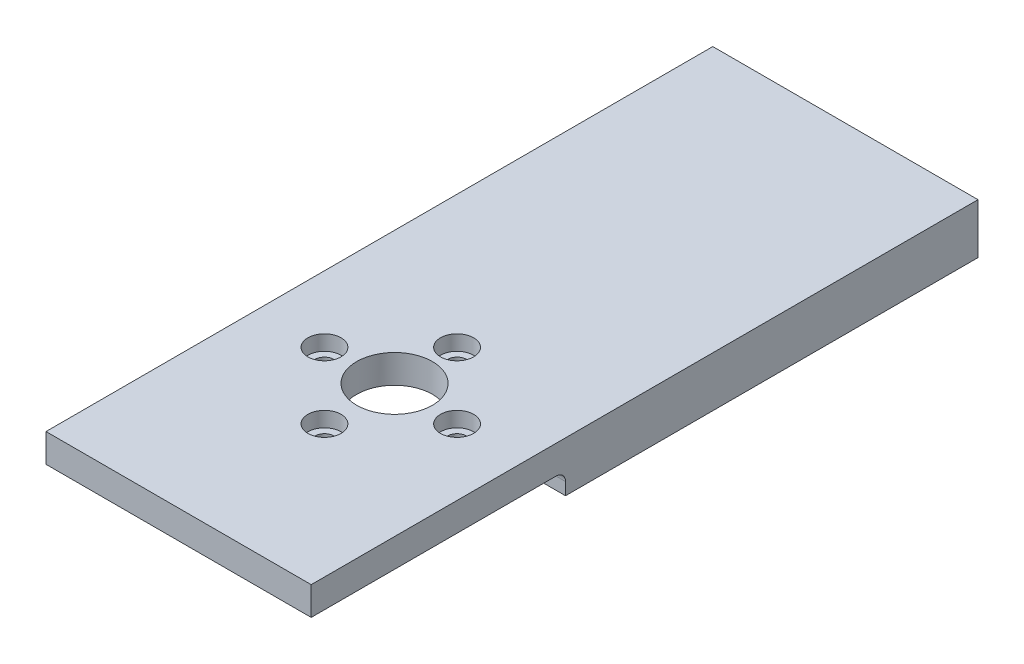
ISO-10303-21;
HEADER;
FILE_DESCRIPTION(('STEP AP214'),'2;1');
FILE_NAME('part.step','',(''),(''),'','','');
FILE_SCHEMA(('AUTOMOTIVE_DESIGN { 1 0 10303 214 1 1 1 1 }'));
ENDSEC;
DATA;
#1=APPLICATION_CONTEXT('core data for automotive mechanical design processes');
#2=APPLICATION_PROTOCOL_DEFINITION('international standard','automotive_design',2000,#1);
#3=PRODUCT_CONTEXT('',#1,'mechanical');
#4=PRODUCT('Part','Part','',(#3));
#5=PRODUCT_RELATED_PRODUCT_CATEGORY('part','',(#4));
#6=PRODUCT_DEFINITION_FORMATION('','',#4);
#7=PRODUCT_DEFINITION_CONTEXT('part definition',#1,'design');
#8=PRODUCT_DEFINITION('design','',#6,#7);
#9=PRODUCT_DEFINITION_SHAPE('','',#8);
#10=(LENGTH_UNIT() NAMED_UNIT(*) SI_UNIT(.MILLI.,.METRE.));
#11=(NAMED_UNIT(*) PLANE_ANGLE_UNIT() SI_UNIT($,.RADIAN.));
#12=(NAMED_UNIT(*) SI_UNIT($,.STERADIAN.) SOLID_ANGLE_UNIT());
#13=UNCERTAINTY_MEASURE_WITH_UNIT(LENGTH_MEASURE(1.E-05),#10,'distance_accuracy_value','');
#14=(GEOMETRIC_REPRESENTATION_CONTEXT(3) GLOBAL_UNCERTAINTY_ASSIGNED_CONTEXT((#13)) GLOBAL_UNIT_ASSIGNED_CONTEXT((#10,
#11,#12)) REPRESENTATION_CONTEXT('',''));
#15=CARTESIAN_POINT('',(0.,0.,0.));
#16=DIRECTION('',(0.,0.,1.));
#17=DIRECTION('',(1.,0.,0.));
#18=AXIS2_PLACEMENT_3D('',#15,#16,#17);
#19=CARTESIAN_POINT('',(7.0000000000001,-7.,12.7999999999978));
#20=DIRECTION('',(0.,1.,0.));
#21=DIRECTION('',(0.,0.,1.));
#22=AXIS2_PLACEMENT_3D('',#19,#20,#21);
#23=CYLINDRICAL_SURFACE('',#22,1.);
#24=CARTESIAN_POINT('',(7.0000000000001,0.,12.7999999999978));
#25=DIRECTION('',(0.,-1.,0.));
#26=DIRECTION('',(0.,0.,-1.));
#27=AXIS2_PLACEMENT_3D('',#24,#25,#26);
#28=CIRCLE('',#27,1.);
#29=CARTESIAN_POINT('',(7.0000000000001,0.,11.7999999999978));
#30=VERTEX_POINT('',#29);
#31=EDGE_CURVE('E224',#30,#30,#28,.T.);
#32=ORIENTED_EDGE('',*,*,#31,.T.);
#33=EDGE_LOOP('',(#32));
#34=FACE_BOUND('',#33,.T.);
#35=CARTESIAN_POINT('',(7.0000000000001,1.4,12.7999999999978));
#36=DIRECTION('',(0.,1.,0.));
#37=DIRECTION('',(0.,0.,1.));
#38=AXIS2_PLACEMENT_3D('',#35,#36,#37);
#39=CIRCLE('',#38,1.);
#40=CARTESIAN_POINT('',(7.0000000000001,1.4,13.7999999999978));
#41=VERTEX_POINT('',#40);
#42=EDGE_CURVE('E173',#41,#41,#39,.F.);
#43=ORIENTED_EDGE('',*,*,#42,.F.);
#44=EDGE_LOOP('',(#43));
#45=FACE_BOUND('',#44,.T.);
#46=ADVANCED_FACE('F39',(#34,#45),#23,.F.);
#47=CARTESIAN_POINT('',(-6.9999999999999,-7.,12.7999999999979));
#48=DIRECTION('',(0.,1.,0.));
#49=DIRECTION('',(0.,0.,1.));
#50=AXIS2_PLACEMENT_3D('',#47,#48,#49);
#51=CYLINDRICAL_SURFACE('',#50,1.);
#52=CARTESIAN_POINT('',(-6.9999999999999,0.,12.7999999999979));
#53=DIRECTION('',(0.,-1.,0.));
#54=DIRECTION('',(0.,0.,-1.));
#55=AXIS2_PLACEMENT_3D('',#52,#53,#54);
#56=CIRCLE('',#55,1.);
#57=CARTESIAN_POINT('',(-6.9999999999999,0.,11.7999999999979));
#58=VERTEX_POINT('',#57);
#59=EDGE_CURVE('E230',#58,#58,#56,.T.);
#60=ORIENTED_EDGE('',*,*,#59,.T.);
#61=EDGE_LOOP('',(#60));
#62=FACE_BOUND('',#61,.T.);
#63=CARTESIAN_POINT('',(-6.9999999999999,1.4,12.7999999999979));
#64=DIRECTION('',(0.,1.,0.));
#65=DIRECTION('',(0.,0.,1.));
#66=AXIS2_PLACEMENT_3D('',#63,#64,#65);
#67=CIRCLE('',#66,1.);
#68=CARTESIAN_POINT('',(-6.9999999999999,1.4,13.7999999999979));
#69=VERTEX_POINT('',#68);
#70=EDGE_CURVE('E179',#69,#69,#67,.F.);
#71=ORIENTED_EDGE('',*,*,#70,.F.);
#72=EDGE_LOOP('',(#71));
#73=FACE_BOUND('',#72,.T.);
#74=ADVANCED_FACE('F269',(#62,#73),#51,.F.);
#75=CARTESIAN_POINT('',(0.,-7.,5.79999999999792));
#76=DIRECTION('',(0.,1.,0.));
#77=DIRECTION('',(0.,0.,1.));
#78=AXIS2_PLACEMENT_3D('',#75,#76,#77);
#79=CYLINDRICAL_SURFACE('',#78,1.);
#80=CARTESIAN_POINT('',(0.,0.,5.79999999999792));
#81=DIRECTION('',(0.,-1.,0.));
#82=DIRECTION('',(0.,0.,-1.));
#83=AXIS2_PLACEMENT_3D('',#80,#81,#82);
#84=CIRCLE('',#83,1.);
#85=CARTESIAN_POINT('',(0.,0.,4.79999999999792));
#86=VERTEX_POINT('',#85);
#87=EDGE_CURVE('E213',#86,#86,#84,.T.);
#88=ORIENTED_EDGE('',*,*,#87,.T.);
#89=EDGE_LOOP('',(#88));
#90=FACE_BOUND('',#89,.T.);
#91=CARTESIAN_POINT('',(0.,1.4,5.79999999999792));
#92=DIRECTION('',(0.,1.,0.));
#93=DIRECTION('',(0.,0.,1.));
#94=AXIS2_PLACEMENT_3D('',#91,#92,#93);
#95=CIRCLE('',#94,1.);
#96=CARTESIAN_POINT('',(0.,1.4,6.79999999999792));
#97=VERTEX_POINT('',#96);
#98=EDGE_CURVE('E186',#97,#97,#95,.F.);
#99=ORIENTED_EDGE('',*,*,#98,.F.);
#100=EDGE_LOOP('',(#99));
#101=FACE_BOUND('',#100,.T.);
#102=ADVANCED_FACE('F275',(#90,#101),#79,.F.);
#103=CARTESIAN_POINT('',(1.45764745514838E-13,-7.,19.7999999999979));
#104=DIRECTION('',(0.,1.,0.));
#105=DIRECTION('',(0.,0.,1.));
#106=AXIS2_PLACEMENT_3D('',#103,#104,#105);
#107=CYLINDRICAL_SURFACE('',#106,1.);
#108=CARTESIAN_POINT('',(1.45764745514838E-13,0.,19.7999999999979));
#109=DIRECTION('',(0.,-1.,0.));
#110=DIRECTION('',(0.,0.,-1.));
#111=AXIS2_PLACEMENT_3D('',#108,#109,#110);
#112=CIRCLE('',#111,1.);
#113=CARTESIAN_POINT('',(1.45764745514838E-13,0.,18.7999999999979));
#114=VERTEX_POINT('',#113);
#115=EDGE_CURVE('E227',#114,#114,#112,.T.);
#116=ORIENTED_EDGE('',*,*,#115,.T.);
#117=EDGE_LOOP('',(#116));
#118=FACE_BOUND('',#117,.T.);
#119=CARTESIAN_POINT('',(1.45764745514838E-13,1.4,19.7999999999979));
#120=DIRECTION('',(0.,1.,0.));
#121=DIRECTION('',(0.,0.,1.));
#122=AXIS2_PLACEMENT_3D('',#119,#120,#121);
#123=CIRCLE('',#122,1.);
#124=CARTESIAN_POINT('',(1.45764745514838E-13,1.4,20.7999999999979));
#125=VERTEX_POINT('',#124);
#126=EDGE_CURVE('E193',#125,#125,#123,.F.);
#127=ORIENTED_EDGE('',*,*,#126,.F.);
#128=EDGE_LOOP('',(#127));
#129=FACE_BOUND('',#128,.T.);
#130=ADVANCED_FACE('F281',(#118,#129),#107,.F.);
#131=CARTESIAN_POINT('',(14.,3.,35.2));
#132=DIRECTION('',(-1.,0.,0.));
#133=DIRECTION('',(0.,0.,1.));
#134=AXIS2_PLACEMENT_3D('',#131,#132,#133);
#135=PLANE('',#134);
#136=DIRECTION('',(0.,0.,-1.));
#137=VECTOR('',#136,1.);
#138=CARTESIAN_POINT('',(14.,0.,35.2));
#139=LINE('',#138,#137);
#140=CARTESIAN_POINT('',(14.,0.,35.2));
#141=VERTEX_POINT('',#140);
#142=CARTESIAN_POINT('',(14.,0.,9.35060235316424));
#143=VERTEX_POINT('',#142);
#144=EDGE_CURVE('E210',#141,#143,#139,.T.);
#145=ORIENTED_EDGE('',*,*,#144,.T.);
#146=CARTESIAN_POINT('',(14.,-1.,9.35060235316424));
#147=DIRECTION('',(-1.,0.,0.));
#148=DIRECTION('',(0.,0.,1.));
#149=AXIS2_PLACEMENT_3D('',#146,#147,#148);
#150=CIRCLE('',#149,1.);
#151=CARTESIAN_POINT('',(14.,-1.,8.35060235316424));
#152=VERTEX_POINT('',#151);
#153=EDGE_CURVE('E53',#143,#152,#150,.T.);
#154=ORIENTED_EDGE('',*,*,#153,.T.);
#155=DIRECTION('',(0.,1.,0.));
#156=VECTOR('',#155,1.);
#157=CARTESIAN_POINT('',(14.,-2.3,8.35060235316424));
#158=LINE('',#157,#156);
#159=CARTESIAN_POINT('',(14.,-2.3,8.35060235316424));
#160=VERTEX_POINT('',#159);
#161=EDGE_CURVE('E143',#160,#152,#158,.T.);
#162=ORIENTED_EDGE('',*,*,#161,.F.);
#163=DIRECTION('',(0.,0.,1.));
#164=VECTOR('',#163,1.);
#165=CARTESIAN_POINT('',(14.,-2.3,-35.2));
#166=LINE('',#165,#164);
#167=CARTESIAN_POINT('',(14.,-2.3,-35.2));
#168=VERTEX_POINT('',#167);
#169=EDGE_CURVE('E139',#168,#160,#166,.T.);
#170=ORIENTED_EDGE('',*,*,#169,.F.);
#171=DIRECTION('',(0.,-1.,0.));
#172=VECTOR('',#171,1.);
#173=CARTESIAN_POINT('',(14.,3.,-35.2));
#174=LINE('',#173,#172);
#175=CARTESIAN_POINT('',(14.,3.,-35.2));
#176=VERTEX_POINT('',#175);
#177=EDGE_CURVE('E125',#176,#168,#174,.T.);
#178=ORIENTED_EDGE('',*,*,#177,.F.);
#179=DIRECTION('',(0.,0.,-1.));
#180=VECTOR('',#179,1.);
#181=CARTESIAN_POINT('',(14.,3.,35.2));
#182=LINE('',#181,#180);
#183=CARTESIAN_POINT('',(14.,3.,35.2));
#184=VERTEX_POINT('',#183);
#185=EDGE_CURVE('E201',#184,#176,#182,.T.);
#186=ORIENTED_EDGE('',*,*,#185,.F.);
#187=DIRECTION('',(0.,-1.,0.));
#188=VECTOR('',#187,1.);
#189=CARTESIAN_POINT('',(14.,3.,35.2));
#190=LINE('',#189,#188);
#191=EDGE_CURVE('E209',#184,#141,#190,.T.);
#192=ORIENTED_EDGE('',*,*,#191,.T.);
#193=EDGE_LOOP('',(#145,#154,#162,#170,#178,#186,#192));
#194=FACE_BOUND('',#193,.T.);
#195=ADVANCED_FACE('F141',(#194),#135,.F.);
#196=CARTESIAN_POINT('',(-14.,3.,-35.2));
#197=DIRECTION('',(0.,0.,1.));
#198=DIRECTION('',(1.,0.,0.));
#199=AXIS2_PLACEMENT_3D('',#196,#197,#198);
#200=PLANE('',#199);
#201=ORIENTED_EDGE('',*,*,#177,.T.);
#202=DIRECTION('',(1.,0.,0.));
#203=VECTOR('',#202,1.);
#204=CARTESIAN_POINT('',(-14.,-2.3,-35.2));
#205=LINE('',#204,#203);
#206=CARTESIAN_POINT('',(-14.,-2.3,-35.2));
#207=VERTEX_POINT('',#206);
#208=EDGE_CURVE('E130',#207,#168,#205,.T.);
#209=ORIENTED_EDGE('',*,*,#208,.F.);
#210=DIRECTION('',(0.,-1.,0.));
#211=VECTOR('',#210,1.);
#212=CARTESIAN_POINT('',(-14.,3.,-35.2));
#213=LINE('',#212,#211);
#214=CARTESIAN_POINT('',(-14.,3.,-35.2));
#215=VERTEX_POINT('',#214);
#216=EDGE_CURVE('E136',#215,#207,#213,.T.);
#217=ORIENTED_EDGE('',*,*,#216,.F.);
#218=DIRECTION('',(-1.,0.,0.));
#219=VECTOR('',#218,1.);
#220=CARTESIAN_POINT('',(-14.,3.,-35.2));
#221=LINE('',#220,#219);
#222=EDGE_CURVE('E131',#176,#215,#221,.T.);
#223=ORIENTED_EDGE('',*,*,#222,.F.);
#224=EDGE_LOOP('',(#201,#209,#217,#223));
#225=FACE_BOUND('',#224,.T.);
#226=ADVANCED_FACE('F127',(#225),#200,.F.);
#227=CARTESIAN_POINT('',(-14.,3.,35.2));
#228=DIRECTION('',(1.,0.,0.));
#229=DIRECTION('',(0.,0.,-1.));
#230=AXIS2_PLACEMENT_3D('',#227,#228,#229);
#231=PLANE('',#230);
#232=ORIENTED_EDGE('',*,*,#216,.T.);
#233=DIRECTION('',(0.,0.,-1.));
#234=VECTOR('',#233,1.);
#235=CARTESIAN_POINT('',(-14.,-2.3,8.35060235316424));
#236=LINE('',#235,#234);
#237=CARTESIAN_POINT('',(-14.,-2.3,8.35060235316424));
#238=VERTEX_POINT('',#237);
#239=EDGE_CURVE('E151',#238,#207,#236,.T.);
#240=ORIENTED_EDGE('',*,*,#239,.F.);
#241=DIRECTION('',(0.,1.,0.));
#242=VECTOR('',#241,1.);
#243=CARTESIAN_POINT('',(-14.,-2.3,8.35060235316424));
#244=LINE('',#243,#242);
#245=CARTESIAN_POINT('',(-14.,-1.,8.35060235316424));
#246=VERTEX_POINT('',#245);
#247=EDGE_CURVE('E162',#238,#246,#244,.T.);
#248=ORIENTED_EDGE('',*,*,#247,.T.);
#249=CARTESIAN_POINT('',(-14.,-1.,9.35060235316424));
#250=DIRECTION('',(1.,0.,0.));
#251=DIRECTION('',(0.,0.,-1.));
#252=AXIS2_PLACEMENT_3D('',#249,#250,#251);
#253=CIRCLE('',#252,1.);
#254=CARTESIAN_POINT('',(-14.,0.,9.35060235316424));
#255=VERTEX_POINT('',#254);
#256=EDGE_CURVE('E11',#246,#255,#253,.T.);
#257=ORIENTED_EDGE('',*,*,#256,.T.);
#258=DIRECTION('',(0.,0.,1.));
#259=VECTOR('',#258,1.);
#260=CARTESIAN_POINT('',(-14.,0.,35.2));
#261=LINE('',#260,#259);
#262=CARTESIAN_POINT('',(-14.,0.,35.2));
#263=VERTEX_POINT('',#262);
#264=EDGE_CURVE('E212',#255,#263,#261,.T.);
#265=ORIENTED_EDGE('',*,*,#264,.T.);
#266=DIRECTION('',(0.,-1.,0.));
#267=VECTOR('',#266,1.);
#268=CARTESIAN_POINT('',(-14.,3.,35.2));
#269=LINE('',#268,#267);
#270=CARTESIAN_POINT('',(-14.,3.,35.2));
#271=VERTEX_POINT('',#270);
#272=EDGE_CURVE('E218',#271,#263,#269,.T.);
#273=ORIENTED_EDGE('',*,*,#272,.F.);
#274=DIRECTION('',(0.,0.,1.));
#275=VECTOR('',#274,1.);
#276=CARTESIAN_POINT('',(-14.,3.,35.2));
#277=LINE('',#276,#275);
#278=EDGE_CURVE('E205',#215,#271,#277,.T.);
#279=ORIENTED_EDGE('',*,*,#278,.F.);
#280=EDGE_LOOP('',(#232,#240,#248,#257,#265,#273,#279));
#281=FACE_BOUND('',#280,.T.);
#282=ADVANCED_FACE('F297',(#281),#231,.F.);
#283=CARTESIAN_POINT('',(-14.,3.,35.2));
#284=DIRECTION('',(0.,0.,-1.));
#285=DIRECTION('',(-1.,0.,0.));
#286=AXIS2_PLACEMENT_3D('',#283,#284,#285);
#287=PLANE('',#286);
#288=DIRECTION('',(1.,0.,0.));
#289=VECTOR('',#288,1.);
#290=CARTESIAN_POINT('',(-14.,0.,35.2));
#291=LINE('',#290,#289);
#292=EDGE_CURVE('E203',#263,#141,#291,.T.);
#293=ORIENTED_EDGE('',*,*,#292,.T.);
#294=ORIENTED_EDGE('',*,*,#191,.F.);
#295=DIRECTION('',(1.,0.,0.));
#296=VECTOR('',#295,1.);
#297=CARTESIAN_POINT('',(-14.,3.,35.2));
#298=LINE('',#297,#296);
#299=EDGE_CURVE('E207',#271,#184,#298,.T.);
#300=ORIENTED_EDGE('',*,*,#299,.F.);
#301=ORIENTED_EDGE('',*,*,#272,.T.);
#302=EDGE_LOOP('',(#293,#294,#300,#301));
#303=FACE_BOUND('',#302,.T.);
#304=ADVANCED_FACE('F289',(#303),#287,.F.);
#305=CARTESIAN_POINT('',(0.,3.,0.));
#306=DIRECTION('',(0.,-1.,0.));
#307=DIRECTION('',(0.,0.,-1.));
#308=AXIS2_PLACEMENT_3D('',#305,#306,#307);
#309=PLANE('',#308);
#310=CARTESIAN_POINT('',(7.0000000000001,3.,12.7999999999978));
#311=DIRECTION('',(0.,1.,0.));
#312=DIRECTION('',(0.,0.,1.));
#313=AXIS2_PLACEMENT_3D('',#310,#311,#312);
#314=CIRCLE('',#313,1.75);
#315=CARTESIAN_POINT('',(7.0000000000001,3.,14.5499999999978));
#316=VERTEX_POINT('',#315);
#317=EDGE_CURVE('E169',#316,#316,#314,.T.);
#318=ORIENTED_EDGE('',*,*,#317,.F.);
#319=EDGE_LOOP('',(#318));
#320=FACE_BOUND('',#319,.T.);
#321=CARTESIAN_POINT('',(-6.9999999999999,3.,12.7999999999979));
#322=DIRECTION('',(0.,1.,0.));
#323=DIRECTION('',(0.,0.,1.));
#324=AXIS2_PLACEMENT_3D('',#321,#322,#323);
#325=CIRCLE('',#324,1.75);
#326=CARTESIAN_POINT('',(-6.9999999999999,3.,14.5499999999979));
#327=VERTEX_POINT('',#326);
#328=EDGE_CURVE('E180',#327,#327,#325,.T.);
#329=ORIENTED_EDGE('',*,*,#328,.F.);
#330=EDGE_LOOP('',(#329));
#331=FACE_BOUND('',#330,.T.);
#332=CARTESIAN_POINT('',(0.,3.,5.79999999999792));
#333=DIRECTION('',(0.,1.,0.));
#334=DIRECTION('',(0.,0.,1.));
#335=AXIS2_PLACEMENT_3D('',#332,#333,#334);
#336=CIRCLE('',#335,1.75);
#337=CARTESIAN_POINT('',(0.,3.,7.54999999999792));
#338=VERTEX_POINT('',#337);
#339=EDGE_CURVE('E187',#338,#338,#336,.T.);
#340=ORIENTED_EDGE('',*,*,#339,.F.);
#341=EDGE_LOOP('',(#340));
#342=FACE_BOUND('',#341,.T.);
#343=CARTESIAN_POINT('',(1.45764745514838E-13,3.,19.7999999999979));
#344=DIRECTION('',(0.,1.,0.));
#345=DIRECTION('',(0.,0.,1.));
#346=AXIS2_PLACEMENT_3D('',#343,#344,#345);
#347=CIRCLE('',#346,1.75);
#348=CARTESIAN_POINT('',(1.45764745514838E-13,3.,21.5499999999979));
#349=VERTEX_POINT('',#348);
#350=EDGE_CURVE('E194',#349,#349,#347,.T.);
#351=ORIENTED_EDGE('',*,*,#350,.F.);
#352=EDGE_LOOP('',(#351));
#353=FACE_BOUND('',#352,.T.);
#354=CARTESIAN_POINT('',(0.,3.,12.3999999999985));
#355=DIRECTION('',(0.,1.,0.));
#356=DIRECTION('',(0.,0.,1.));
#357=AXIS2_PLACEMENT_3D('',#354,#355,#356);
#358=CIRCLE('',#357,4.);
#359=CARTESIAN_POINT('',(0.,3.,16.3999999999985));
#360=VERTEX_POINT('',#359);
#361=EDGE_CURVE('E197',#360,#360,#358,.T.);
#362=ORIENTED_EDGE('',*,*,#361,.F.);
#363=EDGE_LOOP('',(#362));
#364=FACE_BOUND('',#363,.T.);
#365=ORIENTED_EDGE('',*,*,#185,.T.);
#366=ORIENTED_EDGE('',*,*,#222,.T.);
#367=ORIENTED_EDGE('',*,*,#278,.T.);
#368=ORIENTED_EDGE('',*,*,#299,.T.);
#369=EDGE_LOOP('',(#365,#366,#367,#368));
#370=FACE_BOUND('',#369,.T.);
#371=ADVANCED_FACE('F285',(#320,#331,#342,#353,#364,#370),#309,.F.);
#372=CARTESIAN_POINT('',(0.,0.,0.));
#373=DIRECTION('',(0.,-1.,0.));
#374=DIRECTION('',(0.,0.,-1.));
#375=AXIS2_PLACEMENT_3D('',#372,#373,#374);
#376=PLANE('',#375);
#377=CARTESIAN_POINT('',(0.,0.,12.3999999999985));
#378=DIRECTION('',(0.,-1.,0.));
#379=DIRECTION('',(0.,0.,-1.));
#380=AXIS2_PLACEMENT_3D('',#377,#378,#379);
#381=CIRCLE('',#380,9.);
#382=CARTESIAN_POINT('',(-8.46765457440736,0.,9.35060235316428));
#383=VERTEX_POINT('',#382);
#384=CARTESIAN_POINT('',(8.46765457440736,0.,9.35060235316428));
#385=VERTEX_POINT('',#384);
#386=EDGE_CURVE('E245',#383,#385,#381,.T.);
#387=ORIENTED_EDGE('',*,*,#386,.T.);
#388=DIRECTION('',(-1.,0.,0.));
#389=VECTOR('',#388,1.);
#390=CARTESIAN_POINT('',(0.,0.,9.35060235316423));
#391=LINE('',#390,#389);
#392=EDGE_CURVE('E249',#385,#143,#391,.F.);
#393=ORIENTED_EDGE('',*,*,#392,.T.);
#394=ORIENTED_EDGE('',*,*,#144,.F.);
#395=ORIENTED_EDGE('',*,*,#292,.F.);
#396=ORIENTED_EDGE('',*,*,#264,.F.);
#397=DIRECTION('',(-1.,0.,0.));
#398=VECTOR('',#397,1.);
#399=CARTESIAN_POINT('',(0.,0.,9.35060235316423));
#400=LINE('',#399,#398);
#401=EDGE_CURVE('E247',#255,#383,#400,.F.);
#402=ORIENTED_EDGE('',*,*,#401,.T.);
#403=EDGE_LOOP('',(#387,#393,#394,#395,#396,#402));
#404=FACE_BOUND('',#403,.T.);
#405=CARTESIAN_POINT('',(0.,0.,12.3999999999985));
#406=DIRECTION('',(0.,-1.,0.));
#407=DIRECTION('',(0.,0.,-1.));
#408=AXIS2_PLACEMENT_3D('',#405,#406,#407);
#409=CIRCLE('',#408,4.);
#410=CARTESIAN_POINT('',(0.,0.,8.39999999999852));
#411=VERTEX_POINT('',#410);
#412=EDGE_CURVE('E200',#411,#411,#409,.T.);
#413=ORIENTED_EDGE('',*,*,#412,.F.);
#414=EDGE_LOOP('',(#413));
#415=FACE_BOUND('',#414,.T.);
#416=ORIENTED_EDGE('',*,*,#59,.F.);
#417=EDGE_LOOP('',(#416));
#418=FACE_BOUND('',#417,.T.);
#419=ORIENTED_EDGE('',*,*,#115,.F.);
#420=EDGE_LOOP('',(#419));
#421=FACE_BOUND('',#420,.T.);
#422=ORIENTED_EDGE('',*,*,#31,.F.);
#423=EDGE_LOOP('',(#422));
#424=FACE_BOUND('',#423,.T.);
#425=ORIENTED_EDGE('',*,*,#87,.F.);
#426=EDGE_LOOP('',(#425));
#427=FACE_BOUND('',#426,.T.);
#428=ADVANCED_FACE('F288',(#404,#415,#418,#421,#424,#427),#376,.T.);
#429=CARTESIAN_POINT('',(0.,-7.,12.3999999999985));
#430=DIRECTION('',(0.,1.,0.));
#431=DIRECTION('',(0.,0.,1.));
#432=AXIS2_PLACEMENT_3D('',#429,#430,#431);
#433=CYLINDRICAL_SURFACE('',#432,4.);
#434=ORIENTED_EDGE('',*,*,#412,.T.);
#435=EDGE_LOOP('',(#434));
#436=FACE_BOUND('',#435,.T.);
#437=ORIENTED_EDGE('',*,*,#361,.T.);
#438=EDGE_LOOP('',(#437));
#439=FACE_BOUND('',#438,.T.);
#440=ADVANCED_FACE('F293',(#436,#439),#433,.F.);
#441=CARTESIAN_POINT('',(1.45764745514838E-13,1.4,19.7999999999979));
#442=DIRECTION('',(0.,1.,0.));
#443=DIRECTION('',(0.,0.,1.));
#444=AXIS2_PLACEMENT_3D('',#441,#442,#443);
#445=PLANE('',#444);
#446=CARTESIAN_POINT('',(1.45764745514838E-13,1.4,19.7999999999979));
#447=DIRECTION('',(0.,1.,0.));
#448=DIRECTION('',(0.,0.,1.));
#449=AXIS2_PLACEMENT_3D('',#446,#447,#448);
#450=CIRCLE('',#449,1.75);
#451=CARTESIAN_POINT('',(1.45764745514838E-13,1.4,21.5499999999979));
#452=VERTEX_POINT('',#451);
#453=EDGE_CURVE('E190',#452,#452,#450,.T.);
#454=ORIENTED_EDGE('',*,*,#453,.T.);
#455=EDGE_LOOP('',(#454));
#456=FACE_BOUND('',#455,.T.);
#457=ORIENTED_EDGE('',*,*,#126,.T.);
#458=EDGE_LOOP('',(#457));
#459=FACE_BOUND('',#458,.T.);
#460=ADVANCED_FACE('F315',(#456,#459),#445,.T.);
#461=CARTESIAN_POINT('',(1.45764745514838E-13,1.4,19.7999999999979));
#462=DIRECTION('',(0.,1.,0.));
#463=DIRECTION('',(0.,0.,1.));
#464=AXIS2_PLACEMENT_3D('',#461,#462,#463);
#465=CYLINDRICAL_SURFACE('',#464,1.75);
#466=ORIENTED_EDGE('',*,*,#453,.F.);
#467=EDGE_LOOP('',(#466));
#468=FACE_BOUND('',#467,.T.);
#469=ORIENTED_EDGE('',*,*,#350,.T.);
#470=EDGE_LOOP('',(#469));
#471=FACE_BOUND('',#470,.T.);
#472=ADVANCED_FACE('F317',(#468,#471),#465,.F.);
#473=CARTESIAN_POINT('',(0.,1.4,5.79999999999792));
#474=DIRECTION('',(0.,1.,0.));
#475=DIRECTION('',(0.,0.,1.));
#476=AXIS2_PLACEMENT_3D('',#473,#474,#475);
#477=PLANE('',#476);
#478=CARTESIAN_POINT('',(0.,1.4,5.79999999999792));
#479=DIRECTION('',(0.,1.,0.));
#480=DIRECTION('',(0.,0.,1.));
#481=AXIS2_PLACEMENT_3D('',#478,#479,#480);
#482=CIRCLE('',#481,1.75);
#483=CARTESIAN_POINT('',(0.,1.4,7.54999999999792));
#484=VERTEX_POINT('',#483);
#485=EDGE_CURVE('E183',#484,#484,#482,.T.);
#486=ORIENTED_EDGE('',*,*,#485,.T.);
#487=EDGE_LOOP('',(#486));
#488=FACE_BOUND('',#487,.T.);
#489=ORIENTED_EDGE('',*,*,#98,.T.);
#490=EDGE_LOOP('',(#489));
#491=FACE_BOUND('',#490,.T.);
#492=ADVANCED_FACE('F324',(#488,#491),#477,.T.);
#493=CARTESIAN_POINT('',(0.,1.4,5.79999999999792));
#494=DIRECTION('',(0.,1.,0.));
#495=DIRECTION('',(0.,0.,1.));
#496=AXIS2_PLACEMENT_3D('',#493,#494,#495);
#497=CYLINDRICAL_SURFACE('',#496,1.75);
#498=ORIENTED_EDGE('',*,*,#485,.F.);
#499=EDGE_LOOP('',(#498));
#500=FACE_BOUND('',#499,.T.);
#501=ORIENTED_EDGE('',*,*,#339,.T.);
#502=EDGE_LOOP('',(#501));
#503=FACE_BOUND('',#502,.T.);
#504=ADVANCED_FACE('F330',(#500,#503),#497,.F.);
#505=CARTESIAN_POINT('',(-6.9999999999999,1.4,12.7999999999979));
#506=DIRECTION('',(0.,1.,0.));
#507=DIRECTION('',(0.,0.,1.));
#508=AXIS2_PLACEMENT_3D('',#505,#506,#507);
#509=PLANE('',#508);
#510=CARTESIAN_POINT('',(-6.9999999999999,1.4,12.7999999999979));
#511=DIRECTION('',(0.,1.,0.));
#512=DIRECTION('',(0.,0.,1.));
#513=AXIS2_PLACEMENT_3D('',#510,#511,#512);
#514=CIRCLE('',#513,1.75);
#515=CARTESIAN_POINT('',(-6.9999999999999,1.4,14.5499999999979));
#516=VERTEX_POINT('',#515);
#517=EDGE_CURVE('E176',#516,#516,#514,.T.);
#518=ORIENTED_EDGE('',*,*,#517,.T.);
#519=EDGE_LOOP('',(#518));
#520=FACE_BOUND('',#519,.T.);
#521=ORIENTED_EDGE('',*,*,#70,.T.);
#522=EDGE_LOOP('',(#521));
#523=FACE_BOUND('',#522,.T.);
#524=ADVANCED_FACE('F333',(#520,#523),#509,.T.);
#525=CARTESIAN_POINT('',(-6.9999999999999,1.4,12.7999999999979));
#526=DIRECTION('',(0.,1.,0.));
#527=DIRECTION('',(0.,0.,1.));
#528=AXIS2_PLACEMENT_3D('',#525,#526,#527);
#529=CYLINDRICAL_SURFACE('',#528,1.75);
#530=ORIENTED_EDGE('',*,*,#517,.F.);
#531=EDGE_LOOP('',(#530));
#532=FACE_BOUND('',#531,.T.);
#533=ORIENTED_EDGE('',*,*,#328,.T.);
#534=EDGE_LOOP('',(#533));
#535=FACE_BOUND('',#534,.T.);
#536=ADVANCED_FACE('F338',(#532,#535),#529,.F.);
#537=CARTESIAN_POINT('',(7.0000000000001,1.4,12.7999999999978));
#538=DIRECTION('',(0.,1.,0.));
#539=DIRECTION('',(0.,0.,1.));
#540=AXIS2_PLACEMENT_3D('',#537,#538,#539);
#541=PLANE('',#540);
#542=CARTESIAN_POINT('',(7.0000000000001,1.4,12.7999999999978));
#543=DIRECTION('',(0.,1.,0.));
#544=DIRECTION('',(0.,0.,1.));
#545=AXIS2_PLACEMENT_3D('',#542,#543,#544);
#546=CIRCLE('',#545,1.75);
#547=CARTESIAN_POINT('',(7.0000000000001,1.4,14.5499999999978));
#548=VERTEX_POINT('',#547);
#549=EDGE_CURVE('E170',#548,#548,#546,.T.);
#550=ORIENTED_EDGE('',*,*,#549,.T.);
#551=EDGE_LOOP('',(#550));
#552=FACE_BOUND('',#551,.T.);
#553=ORIENTED_EDGE('',*,*,#42,.T.);
#554=EDGE_LOOP('',(#553));
#555=FACE_BOUND('',#554,.T.);
#556=ADVANCED_FACE('F341',(#552,#555),#541,.T.);
#557=CARTESIAN_POINT('',(7.0000000000001,1.4,12.7999999999978));
#558=DIRECTION('',(0.,1.,0.));
#559=DIRECTION('',(0.,0.,1.));
#560=AXIS2_PLACEMENT_3D('',#557,#558,#559);
#561=CYLINDRICAL_SURFACE('',#560,1.75);
#562=ORIENTED_EDGE('',*,*,#549,.F.);
#563=EDGE_LOOP('',(#562));
#564=FACE_BOUND('',#563,.T.);
#565=ORIENTED_EDGE('',*,*,#317,.T.);
#566=EDGE_LOOP('',(#565));
#567=FACE_BOUND('',#566,.T.);
#568=ADVANCED_FACE('F346',(#564,#567),#561,.F.);
#569=CARTESIAN_POINT('',(9.14343363829,-2.3,8.35060235316424));
#570=DIRECTION('',(0.,0.,-1.));
#571=DIRECTION('',(-1.,0.,0.));
#572=AXIS2_PLACEMENT_3D('',#569,#570,#571);
#573=PLANE('',#572);
#574=ORIENTED_EDGE('',*,*,#161,.T.);
#575=DIRECTION('',(-1.,0.,0.));
#576=VECTOR('',#575,1.);
#577=CARTESIAN_POINT('',(9.14343363829,-1.,8.35060235316424));
#578=LINE('',#577,#576);
#579=CARTESIAN_POINT('',(9.14343363829,-1.,8.35060235316424));
#580=VERTEX_POINT('',#579);
#581=EDGE_CURVE('E135',#152,#580,#578,.T.);
#582=ORIENTED_EDGE('',*,*,#581,.T.);
#583=DIRECTION('',(0.,1.,0.));
#584=VECTOR('',#583,1.);
#585=CARTESIAN_POINT('',(9.14343363829,-2.3,8.35060235316424));
#586=LINE('',#585,#584);
#587=CARTESIAN_POINT('',(9.14343363829,-2.3,8.35060235316424));
#588=VERTEX_POINT('',#587);
#589=EDGE_CURVE('E166',#588,#580,#586,.T.);
#590=ORIENTED_EDGE('',*,*,#589,.F.);
#591=DIRECTION('',(-1.,0.,0.));
#592=VECTOR('',#591,1.);
#593=CARTESIAN_POINT('',(9.14343363829,-2.3,8.35060235316424));
#594=LINE('',#593,#592);
#595=EDGE_CURVE('E146',#160,#588,#594,.T.);
#596=ORIENTED_EDGE('',*,*,#595,.F.);
#597=EDGE_LOOP('',(#574,#582,#590,#596));
#598=FACE_BOUND('',#597,.T.);
#599=ADVANCED_FACE('F348',(#598),#573,.F.);
#600=CARTESIAN_POINT('',(0.,-2.3,12.3999999999985));
#601=DIRECTION('',(0.,1.,0.));
#602=DIRECTION('',(0.,0.,1.));
#603=AXIS2_PLACEMENT_3D('',#600,#601,#602);
#604=CYLINDRICAL_SURFACE('',#603,10.);
#605=ORIENTED_EDGE('',*,*,#589,.T.);
#606=CARTESIAN_POINT('',(0.,-1.,12.3999999999985));
#607=DIRECTION('',(0.,-1.,0.));
#608=DIRECTION('',(0.,0.,-1.));
#609=AXIS2_PLACEMENT_3D('',#606,#607,#608);
#610=CIRCLE('',#609,10.);
#611=CARTESIAN_POINT('',(-9.14343363829,-1.,8.35060235316424));
#612=VERTEX_POINT('',#611);
#613=EDGE_CURVE('E61',#580,#612,#610,.F.);
#614=ORIENTED_EDGE('',*,*,#613,.T.);
#615=DIRECTION('',(0.,1.,0.));
#616=VECTOR('',#615,1.);
#617=CARTESIAN_POINT('',(-9.14343363829,-2.3,8.35060235316424));
#618=LINE('',#617,#616);
#619=CARTESIAN_POINT('',(-9.14343363829,-2.3,8.35060235316424));
#620=VERTEX_POINT('',#619);
#621=EDGE_CURVE('E164',#620,#612,#618,.T.);
#622=ORIENTED_EDGE('',*,*,#621,.F.);
#623=CARTESIAN_POINT('',(0.,-2.3,12.3999999999985));
#624=DIRECTION('',(0.,1.,0.));
#625=DIRECTION('',(0.,0.,-1.));
#626=AXIS2_PLACEMENT_3D('',#623,#624,#625);
#627=CIRCLE('',#626,10.);
#628=EDGE_CURVE('E157',#588,#620,#627,.T.);
#629=ORIENTED_EDGE('',*,*,#628,.F.);
#630=EDGE_LOOP('',(#605,#614,#622,#629));
#631=FACE_BOUND('',#630,.T.);
#632=ADVANCED_FACE('F355',(#631),#604,.F.);
#633=CARTESIAN_POINT('',(-9.14343363829,-2.3,8.35060235316424));
#634=DIRECTION('',(0.,0.,-1.));
#635=DIRECTION('',(-1.,0.,0.));
#636=AXIS2_PLACEMENT_3D('',#633,#634,#635);
#637=PLANE('',#636);
#638=ORIENTED_EDGE('',*,*,#621,.T.);
#639=DIRECTION('',(-1.,0.,0.));
#640=VECTOR('',#639,1.);
#641=CARTESIAN_POINT('',(-9.14343363829,-1.,8.35060235316424));
#642=LINE('',#641,#640);
#643=EDGE_CURVE('E68',#612,#246,#642,.T.);
#644=ORIENTED_EDGE('',*,*,#643,.T.);
#645=ORIENTED_EDGE('',*,*,#247,.F.);
#646=DIRECTION('',(-1.,0.,0.));
#647=VECTOR('',#646,1.);
#648=CARTESIAN_POINT('',(-9.14343363829,-2.3,8.35060235316424));
#649=LINE('',#648,#647);
#650=EDGE_CURVE('E159',#620,#238,#649,.T.);
#651=ORIENTED_EDGE('',*,*,#650,.F.);
#652=EDGE_LOOP('',(#638,#644,#645,#651));
#653=FACE_BOUND('',#652,.T.);
#654=ADVANCED_FACE('F359',(#653),#637,.F.);
#655=CARTESIAN_POINT('',(0.,-2.3,12.3999999999985));
#656=DIRECTION('',(0.,-1.,0.));
#657=DIRECTION('',(0.,0.,-1.));
#658=AXIS2_PLACEMENT_3D('',#655,#656,#657);
#659=PLANE('',#658);
#660=ORIENTED_EDGE('',*,*,#208,.T.);
#661=ORIENTED_EDGE('',*,*,#169,.T.);
#662=ORIENTED_EDGE('',*,*,#595,.T.);
#663=ORIENTED_EDGE('',*,*,#628,.T.);
#664=ORIENTED_EDGE('',*,*,#650,.T.);
#665=ORIENTED_EDGE('',*,*,#239,.T.);
#666=EDGE_LOOP('',(#660,#661,#662,#663,#664,#665));
#667=FACE_BOUND('',#666,.T.);
#668=ADVANCED_FACE('F149',(#667),#659,.T.);
#669=CARTESIAN_POINT('',(-9.14343363829,-1.,9.35060235316424));
#670=DIRECTION('',(-1.,0.,0.));
#671=DIRECTION('',(0.,0.,1.));
#672=AXIS2_PLACEMENT_3D('',#669,#670,#671);
#673=CYLINDRICAL_SURFACE('',#672,1.);
#674=ORIENTED_EDGE('',*,*,#256,.F.);
#675=ORIENTED_EDGE('',*,*,#643,.F.);
#676=CARTESIAN_POINT('',(-9.14343363829,-1.,8.35060235316424));
#677=CARTESIAN_POINT('',(-9.14343461053937,-0.975154963052472,8.3506005580863));
#678=CARTESIAN_POINT('',(-9.14283058961965,-0.950323177112561,8.35152900054944));
#679=CARTESIAN_POINT('',(-9.14042824825604,-0.900863690523177,8.35521972686082));
#680=CARTESIAN_POINT('',(-9.13863038068967,-0.87623591606879,8.35798131531758));
#681=CARTESIAN_POINT('',(-9.13149586384829,-0.803173350628478,8.36893543513491));
#682=CARTESIAN_POINT('',(-9.12441788599401,-0.755274231544873,8.37979801135118));
#683=CARTESIAN_POINT('',(-9.10597268683131,-0.662424316636971,8.40805230806942));
#684=CARTESIAN_POINT('',(-9.09461007066699,-0.617470415955001,8.42543701845735));
#685=CARTESIAN_POINT('',(-9.06808509641301,-0.531388229930284,8.46591730735583));
#686=CARTESIAN_POINT('',(-9.05291899255718,-0.490263770988202,8.48901851531074));
#687=CARTESIAN_POINT('',(-9.01838156665716,-0.410329312860556,8.54146427300887));
#688=CARTESIAN_POINT('',(-8.99881814045281,-0.371789645102526,8.57109208800353));
#689=CARTESIAN_POINT('',(-8.956725990255,-0.300266912464186,8.63459725074127));
#690=CARTESIAN_POINT('',(-8.93419668225641,-0.267284944861999,8.66847543535323));
#691=CARTESIAN_POINT('',(-8.88313576202384,-0.202475179383938,8.74493414388105));
#692=CARTESIAN_POINT('',(-8.85421292191901,-0.171592693499552,8.78805356459945));
#693=CARTESIAN_POINT('',(-8.79397634219176,-0.117508504356354,8.87737833813653));
#694=CARTESIAN_POINT('',(-8.76265940370554,-0.0943173065542169,8.92358780901431));
#695=CARTESIAN_POINT('',(-8.68925886965893,-0.05010073120671,9.03127752548062));
#696=CARTESIAN_POINT('',(-8.64662742568191,-0.0315257263639088,9.09339265298753));
#697=CARTESIAN_POINT('',(-8.55985488061005,-0.00666256830652087,9.21884565796259));
#698=CARTESIAN_POINT('',(-8.51571683165117,-0.000350918817646183,9.28218096188025));
#699=CARTESIAN_POINT('',(-8.47015366369448,-4.73986895453556E-06,9.34704578119831));
#700=CARTESIAN_POINT('',(-8.46890418198848,3.1690335729013E-09,9.34882417645761));
#701=CARTESIAN_POINT('',(-8.46765457440734,0.,9.35060235316424));
#702=B_SPLINE_CURVE_WITH_KNOTS('',3,(#676,#677,#678,#679,#680,#681,#682,#683,#684,#685,#686,
#687,#688,#689,#690,#691,#692,#693,#694,#695,#696,#697,#698,#699,#700,#701),.UNSPECIFIED.,.F.,
.F.,(4,2,2,2,2,2,2,2,2,2,2,2,4),(0.,0.0744847425366992,0.148941245927169,0.297010913028024,
0.444921885867375,0.59297910097198,0.749576529712543,0.906204839952591,1.08675057457366,
1.26754190887374,1.49926128590943,1.73053625505292,1.73705660223301),.UNSPECIFIED.);
#703=EDGE_CURVE('E44',#383,#612,#702,.F.);
#704=ORIENTED_EDGE('',*,*,#703,.F.);
#705=ORIENTED_EDGE('',*,*,#401,.F.);
#706=EDGE_LOOP('',(#674,#675,#704,#705));
#707=FACE_BOUND('',#706,.T.);
#708=ADVANCED_FACE('F41',(#707),#673,.F.);
#709=CARTESIAN_POINT('',(0.,-1.,12.3999999999985));
#710=DIRECTION('',(0.,-1.,0.));
#711=DIRECTION('',(0.,0.,-1.));
#712=AXIS2_PLACEMENT_3D('',#709,#710,#711);
#713=TOROIDAL_SURFACE('',#712,9.,1.);
#714=ORIENTED_EDGE('',*,*,#703,.T.);
#715=ORIENTED_EDGE('',*,*,#613,.F.);
#716=CARTESIAN_POINT('',(9.14343363829,-1.,8.35060235316424));
#717=CARTESIAN_POINT('',(9.14343461053937,-0.975154963052472,8.3506005580863));
#718=CARTESIAN_POINT('',(9.14283058961965,-0.950323177112561,8.35152900054944));
#719=CARTESIAN_POINT('',(9.14042824825604,-0.900863690523178,8.35521972686083));
#720=CARTESIAN_POINT('',(9.13863038068967,-0.87623591606879,8.35798131531758));
#721=CARTESIAN_POINT('',(9.1314958638483,-0.803173350628478,8.36893543513491));
#722=CARTESIAN_POINT('',(9.12441788599401,-0.755274231544873,8.37979801135118));
#723=CARTESIAN_POINT('',(9.10597268683131,-0.662424316636971,8.40805230806942));
#724=CARTESIAN_POINT('',(9.09461007066699,-0.617470415955001,8.42543701845735));
#725=CARTESIAN_POINT('',(9.06808509641301,-0.531388229930284,8.46591730735583));
#726=CARTESIAN_POINT('',(9.05291899255718,-0.490263770988202,8.48901851531074));
#727=CARTESIAN_POINT('',(9.01838156665716,-0.410329312860556,8.54146427300887));
#728=CARTESIAN_POINT('',(8.99881814045281,-0.371789645102526,8.57109208800353));
#729=CARTESIAN_POINT('',(8.95672599025501,-0.300266912464186,8.63459725074127));
#730=CARTESIAN_POINT('',(8.93419668225642,-0.267284944861999,8.66847543535323));
#731=CARTESIAN_POINT('',(8.88313576202384,-0.202475179383938,8.74493414388105));
#732=CARTESIAN_POINT('',(8.85421292191901,-0.171592693499552,8.78805356459945));
#733=CARTESIAN_POINT('',(8.79397634219176,-0.117508504356354,8.87737833813653));
#734=CARTESIAN_POINT('',(8.76265940370555,-0.0943173065542169,8.92358780901431));
#735=CARTESIAN_POINT('',(8.68925886965893,-0.0501007312067102,9.03127752548062));
#736=CARTESIAN_POINT('',(8.64662742568191,-0.0315257263639089,9.09339265298753));
#737=CARTESIAN_POINT('',(8.55985488061006,-0.0066625683065212,9.21884565796259));
#738=CARTESIAN_POINT('',(8.51571683165118,-0.000350918817646851,9.28218096188025));
#739=CARTESIAN_POINT('',(8.47015366369449,-4.73986895457246E-06,9.34704578119831));
#740=CARTESIAN_POINT('',(8.46890418198848,3.16903355406632E-09,9.34882417645761));
#741=CARTESIAN_POINT('',(8.46765457440734,0.,9.35060235316424));
#742=B_SPLINE_CURVE_WITH_KNOTS('',3,(#716,#717,#718,#719,#720,#721,#722,#723,#724,#725,#726,
#727,#728,#729,#730,#731,#732,#733,#734,#735,#736,#737,#738,#739,#740,#741),.UNSPECIFIED.,.F.,
.F.,(4,2,2,2,2,2,2,2,2,2,2,2,4),(0.,0.0744847425366989,0.148941245927169,0.297010913028024,
0.444921885867375,0.59297910097198,0.749576529712543,0.906204839952591,1.08675057457366,
1.26754190887374,1.49926128590943,1.73053625505292,1.73705660223301),.UNSPECIFIED.);
#743=EDGE_CURVE('E154',#385,#580,#742,.F.);
#744=ORIENTED_EDGE('',*,*,#743,.F.);
#745=ORIENTED_EDGE('',*,*,#386,.F.);
#746=EDGE_LOOP('',(#714,#715,#744,#745));
#747=FACE_BOUND('',#746,.T.);
#748=ADVANCED_FACE('F256',(#747),#713,.F.);
#749=CARTESIAN_POINT('',(9.14343363829,-1.,9.35060235316424));
#750=DIRECTION('',(-1.,0.,0.));
#751=DIRECTION('',(0.,0.,1.));
#752=AXIS2_PLACEMENT_3D('',#749,#750,#751);
#753=CYLINDRICAL_SURFACE('',#752,1.);
#754=ORIENTED_EDGE('',*,*,#153,.F.);
#755=ORIENTED_EDGE('',*,*,#392,.F.);
#756=ORIENTED_EDGE('',*,*,#743,.T.);
#757=ORIENTED_EDGE('',*,*,#581,.F.);
#758=EDGE_LOOP('',(#754,#755,#756,#757));
#759=FACE_BOUND('',#758,.T.);
#760=ADVANCED_FACE('F259',(#759),#753,.F.);
#761=CLOSED_SHELL('',(#46,#74,#102,#130,#195,#226,#282,#304,#371,#428,#440,#460,#472,#492,#504,
#524,#536,#556,#568,#599,#632,#654,#668,#708,#748,#760));
#762=MANIFOLD_SOLID_BREP('B2',#761);
#763=ADVANCED_BREP_SHAPE_REPRESENTATION('',(#18,#762),#14);
#764=SHAPE_DEFINITION_REPRESENTATION(#9,#763);
ENDSEC;
END-ISO-10303-21;
